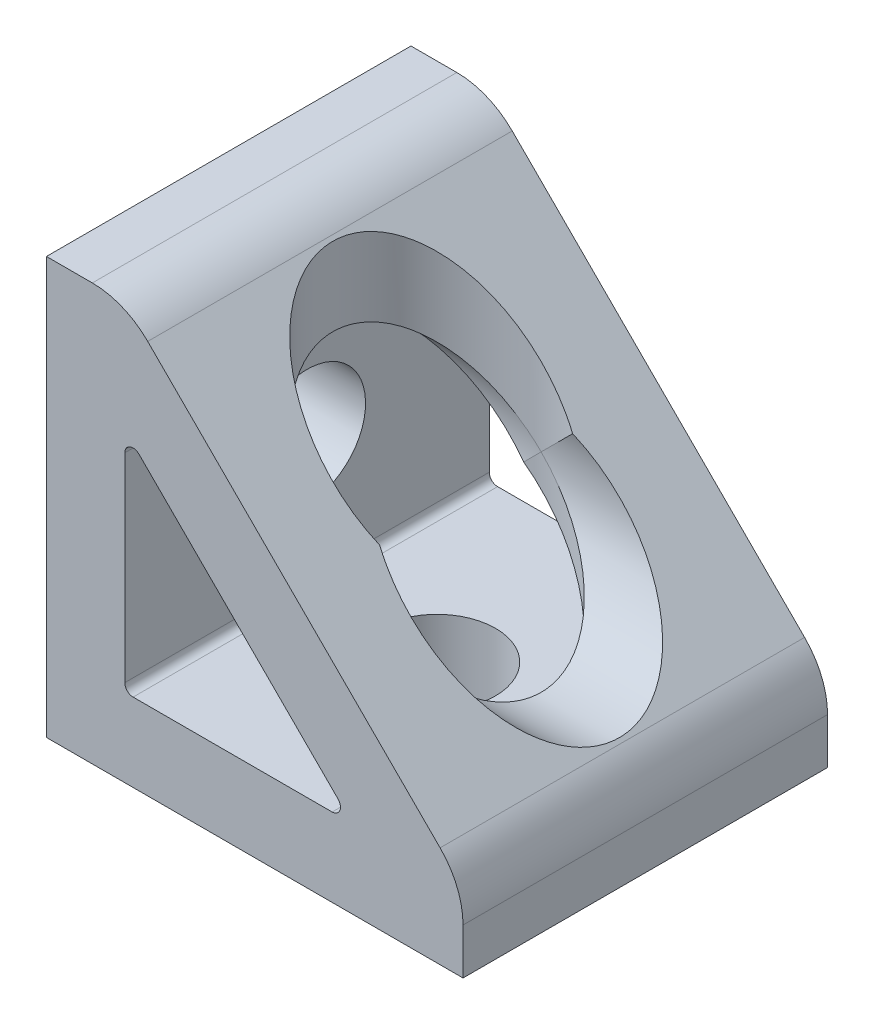
ISO-10303-21;
HEADER;
FILE_DESCRIPTION(('STEP AP214'),'2;1');
FILE_NAME('part.step','',(''),(''),'','','');
FILE_SCHEMA(('AUTOMOTIVE_DESIGN { 1 0 10303 214 1 1 1 1 }'));
ENDSEC;
DATA;
#1=APPLICATION_CONTEXT('core data for automotive mechanical design processes');
#2=APPLICATION_PROTOCOL_DEFINITION('international standard','automotive_design',2000,#1);
#3=PRODUCT_CONTEXT('',#1,'mechanical');
#4=PRODUCT('Part','Part','',(#3));
#5=PRODUCT_RELATED_PRODUCT_CATEGORY('part','',(#4));
#6=PRODUCT_DEFINITION_FORMATION('','',#4);
#7=PRODUCT_DEFINITION_CONTEXT('part definition',#1,'design');
#8=PRODUCT_DEFINITION('design','',#6,#7);
#9=PRODUCT_DEFINITION_SHAPE('','',#8);
#10=(LENGTH_UNIT() NAMED_UNIT(*) SI_UNIT(.MILLI.,.METRE.));
#11=(NAMED_UNIT(*) PLANE_ANGLE_UNIT() SI_UNIT($,.RADIAN.));
#12=(NAMED_UNIT(*) SI_UNIT($,.STERADIAN.) SOLID_ANGLE_UNIT());
#13=UNCERTAINTY_MEASURE_WITH_UNIT(LENGTH_MEASURE(1.E-05),#10,'distance_accuracy_value','');
#14=(GEOMETRIC_REPRESENTATION_CONTEXT(3) GLOBAL_UNCERTAINTY_ASSIGNED_CONTEXT((#13)) GLOBAL_UNIT_ASSIGNED_CONTEXT((#10,
#11,#12)) REPRESENTATION_CONTEXT('',''));
#15=CARTESIAN_POINT('',(0.,0.,0.));
#16=DIRECTION('',(0.,0.,1.));
#17=DIRECTION('',(1.,0.,0.));
#18=AXIS2_PLACEMENT_3D('',#15,#16,#17);
#19=CARTESIAN_POINT('',(12.7,25.4,0.));
#20=DIRECTION('',(0.,-1.,0.));
#21=DIRECTION('',(0.,0.,-1.));
#22=AXIS2_PLACEMENT_3D('',#19,#20,#21);
#23=CYLINDRICAL_SURFACE('',#22,6.35);
#24=CARTESIAN_POINT('',(12.7,17.4752,0.));
#25=DIRECTION('',(-0.707106781186548,-0.707106781186548,0.));
#26=DIRECTION('',(0.707106781186548,-0.707106781186548,0.));
#27=AXIS2_PLACEMENT_3D('',#24,#25,#26);
#28=ELLIPSE('',#27,8.98025612106915,6.35);
#29=CARTESIAN_POINT('',(15.0876,15.0876,-5.88403486053576));
#30=VERTEX_POINT('',#29);
#31=CARTESIAN_POINT('',(15.0876,15.0876,5.88403486053576));
#32=VERTEX_POINT('',#31);
#33=EDGE_CURVE('E354',#30,#32,#28,.F.);
#34=ORIENTED_EDGE('',*,*,#33,.T.);
#35=CARTESIAN_POINT('',(12.7,12.7,0.));
#36=DIRECTION('',(0.707106781186548,-0.707106781186547,0.));
#37=DIRECTION('',(-0.707106781186547,-0.707106781186548,0.));
#38=AXIS2_PLACEMENT_3D('',#35,#36,#37);
#39=ELLIPSE('',#38,8.98025612106915,6.35);
#40=CARTESIAN_POINT('',(12.7,12.7,6.35));
#41=VERTEX_POINT('',#40);
#42=EDGE_CURVE('E176',#32,#41,#39,.T.);
#43=ORIENTED_EDGE('',*,*,#42,.T.);
#44=CARTESIAN_POINT('',(12.7,12.7,0.));
#45=DIRECTION('',(-0.707106781186547,-0.707106781186548,0.));
#46=DIRECTION('',(0.707106781186548,-0.707106781186547,0.));
#47=AXIS2_PLACEMENT_3D('',#44,#45,#46);
#48=ELLIPSE('',#47,8.98025612106915,6.35);
#49=CARTESIAN_POINT('',(12.7,12.7,-6.35));
#50=VERTEX_POINT('',#49);
#51=EDGE_CURVE('E164',#41,#50,#48,.T.);
#52=ORIENTED_EDGE('',*,*,#51,.T.);
#53=CARTESIAN_POINT('',(12.7,12.7,0.));
#54=DIRECTION('',(-0.707106781186548,0.707106781186547,0.));
#55=DIRECTION('',(-0.707106781186547,-0.707106781186548,0.));
#56=AXIS2_PLACEMENT_3D('',#53,#54,#55);
#57=ELLIPSE('',#56,8.98025612106915,6.35);
#58=EDGE_CURVE('E169',#30,#50,#57,.T.);
#59=ORIENTED_EDGE('',*,*,#58,.F.);
#60=EDGE_LOOP('',(#34,#43,#52,#59));
#61=FACE_BOUND('',#60,.T.);
#62=ADVANCED_FACE('F15',(#61),#23,.F.);
#63=CARTESIAN_POINT('',(25.4,12.7,0.));
#64=DIRECTION('',(-1.,0.,0.));
#65=DIRECTION('',(0.,-1.,0.));
#66=AXIS2_PLACEMENT_3D('',#63,#64,#65);
#67=CYLINDRICAL_SURFACE('',#66,6.35);
#68=CARTESIAN_POINT('',(17.4752,12.7,0.));
#69=DIRECTION('',(-0.707106781186548,-0.707106781186548,0.));
#70=DIRECTION('',(-0.707106781186548,0.707106781186548,0.));
#71=AXIS2_PLACEMENT_3D('',#68,#69,#70);
#72=ELLIPSE('',#71,8.98025612106915,6.35);
#73=EDGE_CURVE('E172',#32,#30,#72,.F.);
#74=ORIENTED_EDGE('',*,*,#73,.T.);
#75=ORIENTED_EDGE('',*,*,#58,.T.);
#76=CARTESIAN_POINT('',(12.7,12.7,0.));
#77=DIRECTION('',(-0.707106781186547,-0.707106781186548,0.));
#78=DIRECTION('',(-0.707106781186548,0.707106781186547,0.));
#79=AXIS2_PLACEMENT_3D('',#76,#77,#78);
#80=ELLIPSE('',#79,8.98025612106915,6.35);
#81=EDGE_CURVE('E148',#50,#41,#80,.T.);
#82=ORIENTED_EDGE('',*,*,#81,.T.);
#83=ORIENTED_EDGE('',*,*,#42,.F.);
#84=EDGE_LOOP('',(#74,#75,#82,#83));
#85=FACE_BOUND('',#84,.T.);
#86=ADVANCED_FACE('F170',(#85),#67,.F.);
#87=CARTESIAN_POINT('',(17.4204269072705,5.2832,11.1125));
#88=DIRECTION('',(0.,0.,-1.));
#89=DIRECTION('',(-1.,0.,0.));
#90=AXIS2_PLACEMENT_3D('',#87,#88,#89);
#91=CYLINDRICAL_SURFACE('',#90,0.507999999999998);
#92=CARTESIAN_POINT('',(17.7796371521132,5.64241024484277,3.81048374919394));
#93=CARTESIAN_POINT('',(17.7883333124472,5.63370856311354,3.79889138080289));
#94=CARTESIAN_POINT('',(17.7968318828416,5.62458349521479,3.78747906709042));
#95=CARTESIAN_POINT('',(17.8133986981704,5.60537916131748,3.76508284849013));
#96=CARTESIAN_POINT('',(17.8214656298365,5.59529721644453,3.75410027562521));
#97=CARTESIAN_POINT('',(17.845116428317,5.56322842926829,3.72169206560348));
#98=CARTESIAN_POINT('',(17.8598958230457,5.53966448295931,3.70114636974854));
#99=CARTESIAN_POINT('',(17.8810924886656,5.49805620283357,3.67137249799756));
#100=CARTESIAN_POINT('',(17.8885219657932,5.48144766364685,3.66085708987994));
#101=CARTESIAN_POINT('',(17.9018070766133,5.44654991824729,3.64195486288475));
#102=CARTESIAN_POINT('',(17.9076700681061,5.42826913070793,3.63355810342968));
#103=CARTESIAN_POINT('',(17.9166075365671,5.39336530960493,3.62071223652807));
#104=CARTESIAN_POINT('',(17.9199849010382,5.37697915115832,3.61583705936111));
#105=CARTESIAN_POINT('',(17.9251279628338,5.34343306471349,3.60840111990062));
#106=CARTESIAN_POINT('',(17.9268941679798,5.3262733823132,3.60583962835855));
#107=CARTESIAN_POINT('',(17.9286548266346,5.29160179665178,3.60328620101482));
#108=CARTESIAN_POINT('',(17.9286425196726,5.27408880245012,3.60330406986407));
#109=CARTESIAN_POINT('',(17.9268301762173,5.23935342325999,3.60593241684237));
#110=CARTESIAN_POINT('',(17.9250295700926,5.22213113264778,3.60854372106509));
#111=CARTESIAN_POINT('',(17.9199552088587,5.18942107284772,3.61587965499263));
#112=CARTESIAN_POINT('',(17.9167695871463,5.17389017844441,3.62047776327796));
#113=CARTESIAN_POINT('',(17.9091675862811,5.14377949301812,3.63140709900997));
#114=CARTESIAN_POINT('',(17.9047507311679,5.12920007250359,3.63773899667438));
#115=CARTESIAN_POINT('',(17.8918125900947,5.09229033092581,3.65619671030874));
#116=CARTESIAN_POINT('',(17.8824535417514,5.07082680530542,3.66946707518853));
#117=CARTESIAN_POINT('',(17.8617960798292,5.03067317538378,3.69847020640858));
#118=CARTESIAN_POINT('',(17.8504919154002,5.01199161069783,3.71421026201154));
#119=CARTESIAN_POINT('',(17.8191201500256,4.96654401619267,3.75741714079145));
#120=CARTESIAN_POINT('',(17.7979147534765,4.94180261343145,3.78617800705458));
#121=CARTESIAN_POINT('',(17.753003271266,4.89791670491141,3.84591628870004));
#122=CARTESIAN_POINT('',(17.7292906766661,4.87878727910359,3.87689940277821));
#123=CARTESIAN_POINT('',(17.6686922203378,4.83787692204293,3.95449037561444));
#124=CARTESIAN_POINT('',(17.630748506309,4.81889679757743,4.00175305373392));
#125=CARTESIAN_POINT('',(17.5521217993657,4.79080014757748,4.09673128578227));
#126=CARTESIAN_POINT('',(17.5114440480836,4.78166528938716,4.14444583051086));
#127=CARTESIAN_POINT('',(17.4535207465419,4.77601780812482,4.210364646228));
#128=CARTESIAN_POINT('',(17.4370271200594,4.77520995303944,4.22891486166735));
#129=CARTESIAN_POINT('',(17.4204269072705,4.7752,4.24736033473935));
#130=B_SPLINE_CURVE_WITH_KNOTS('',3,(#92,#93,#94,#95,#96,#97,#98,#99,#100,#101,#102,#103,#104,
#105,#106,#107,#108,#109,#110,#111,#112,#113,#114,#115,#116,#117,#118,#119,#120,#121,#122,#123,
#124,#125,#126,#127,#128,#129),.UNSPECIFIED.,.F.,.F.,(4,2,2,2,2,2,2,2,2,2,2,2,2,2,2,2,2,2,4),
(0.,0.0506837306520263,0.101513794219076,0.204635683435221,0.267505038050829,0.330073685533628,
0.382138884926963,0.434187668203855,0.486434304227522,0.538697587846183,0.588034428624639,
0.637390368159527,0.717669114407369,0.798189421008752,0.927853058393364,1.05786198911492,
1.24743713587404,1.43665866572774,1.51111326173056),.UNSPECIFIED.);
#131=CARTESIAN_POINT('',(17.7796371521132,5.64241024484277,3.81048374919394));
#132=VERTEX_POINT('',#131);
#133=CARTESIAN_POINT('',(17.4204269072705,4.7752,4.24736033473935));
#134=VERTEX_POINT('',#133);
#135=EDGE_CURVE('E159',#132,#134,#130,.T.);
#136=ORIENTED_EDGE('',*,*,#135,.T.);
#137=DIRECTION('',(0.,0.,1.));
#138=VECTOR('',#137,1.);
#139=CARTESIAN_POINT('',(17.4204269072705,4.7752,11.1125));
#140=LINE('',#139,#138);
#141=CARTESIAN_POINT('',(17.4204269072705,4.7752,11.1125));
#142=VERTEX_POINT('',#141);
#143=EDGE_CURVE('E351',#142,#134,#140,.F.);
#144=ORIENTED_EDGE('',*,*,#143,.F.);
#145=CARTESIAN_POINT('',(17.4204269072705,5.2832,11.1125));
#146=DIRECTION('',(0.,0.,-1.));
#147=DIRECTION('',(-1.,0.,0.));
#148=AXIS2_PLACEMENT_3D('',#145,#146,#147);
#149=CIRCLE('',#148,0.507999999999998);
#150=CARTESIAN_POINT('',(17.7796371521132,5.64241024484277,11.1125));
#151=VERTEX_POINT('',#150);
#152=EDGE_CURVE('E436',#151,#142,#149,.T.);
#153=ORIENTED_EDGE('',*,*,#152,.F.);
#154=DIRECTION('',(0.,0.,1.));
#155=VECTOR('',#154,1.);
#156=CARTESIAN_POINT('',(17.7796371521132,5.64241024484277,11.1125));
#157=LINE('',#156,#155);
#158=EDGE_CURVE('E358',#132,#151,#157,.T.);
#159=ORIENTED_EDGE('',*,*,#158,.F.);
#160=EDGE_LOOP('',(#136,#144,#153,#159));
#161=FACE_BOUND('',#160,.T.);
#162=ADVANCED_FACE('F447',(#161),#91,.F.);
#163=CARTESIAN_POINT('',(5.2832,17.4204269072705,11.1125));
#164=DIRECTION('',(0.,0.,-1.));
#165=DIRECTION('',(-1.,0.,0.));
#166=AXIS2_PLACEMENT_3D('',#163,#164,#165);
#167=CYLINDRICAL_SURFACE('',#166,0.508);
#168=CARTESIAN_POINT('',(4.7752,17.4204269072704,4.24736033473935));
#169=CARTESIAN_POINT('',(4.77521046724601,17.4420924856764,4.22328508045935));
#170=CARTESIAN_POINT('',(4.77658605471394,17.4635662308095,4.19904582709387));
#171=CARTESIAN_POINT('',(4.78200159472634,17.5060131520486,4.15039429932005));
#172=CARTESIAN_POINT('',(4.78604351709437,17.5269859461851,4.12598191020381));
#173=CARTESIAN_POINT('',(4.79678199208576,17.5684994852333,4.07691772352855));
#174=CARTESIAN_POINT('',(4.80350610470041,17.5890333365038,4.05226611774794));
#175=CARTESIAN_POINT('',(4.81961765940842,17.6292935812707,4.00319516862432));
#176=CARTESIAN_POINT('',(4.82900389569489,17.6490203357225,3.97877572528728));
#177=CARTESIAN_POINT('',(4.85455357115968,17.6947394093427,3.92133656460339));
#178=CARTESIAN_POINT('',(4.87193874939082,17.7203148602738,3.88851705199913));
#179=CARTESIAN_POINT('',(4.91237240067932,17.7690703949101,3.82473811417215));
#180=CARTESIAN_POINT('',(4.9354004825951,17.7922586856149,3.79377248031576));
#181=CARTESIAN_POINT('',(4.97791824667546,17.8270004785444,3.74658101072067));
#182=CARTESIAN_POINT('',(4.99535181365528,17.8395940700084,3.72927348245638));
#183=CARTESIAN_POINT('',(5.03302106404657,17.863108232783,3.69664903722876));
#184=CARTESIAN_POINT('',(5.05325324857269,17.8740308578064,3.68132968026151));
#185=CARTESIAN_POINT('',(5.09114655378691,17.8910574220427,3.65726436442134));
#186=CARTESIAN_POINT('',(5.10813847665273,17.8976789749363,3.64783982251966));
#187=CARTESIAN_POINT('',(5.14373439367388,17.9092642191962,3.63127642560542));
#188=CARTESIAN_POINT('',(5.16233579994144,17.9142305118781,3.62413398490661));
#189=CARTESIAN_POINT('',(5.19743703216341,17.9213962914119,3.61380042328051));
#190=CARTESIAN_POINT('',(5.21372677322737,17.9239297564496,3.61013390639403));
#191=CARTESIAN_POINT('',(5.24682501316101,17.9273953129222,3.60511413516427));
#192=CARTESIAN_POINT('',(5.26363309486034,17.9283286596024,3.6037590675622));
#193=CARTESIAN_POINT('',(5.29730447707779,17.9285104709857,3.60349529156194));
#194=CARTESIAN_POINT('',(5.31416782281174,17.927756317429,3.60459038473776));
#195=CARTESIAN_POINT('',(5.3474214082833,17.9246285205018,3.60912233530311));
#196=CARTESIAN_POINT('',(5.36381132370793,17.9222537931886,3.61256076005944));
#197=CARTESIAN_POINT('',(5.39943025782155,17.9153565231575,3.62251299486325));
#198=CARTESIAN_POINT('',(5.41843841204279,17.9104640845815,3.62955440383875));
#199=CARTESIAN_POINT('',(5.4548178207322,17.89894290879,3.64603808381968));
#200=CARTESIAN_POINT('',(5.47218546922247,17.892310462367,3.65548548244433));
#201=CARTESIAN_POINT('',(5.51333857652347,17.8741082748739,3.68123036161128));
#202=CARTESIAN_POINT('',(5.53607437061717,17.8617153299734,3.69861048602099));
#203=CARTESIAN_POINT('',(5.57802257558475,17.834874461339,3.7357851633193));
#204=CARTESIAN_POINT('',(5.59723052062932,17.8204239735057,3.75558272435373));
#205=CARTESIAN_POINT('',(5.62450634899135,17.7969006642059,3.78738763194976));
#206=CARTESIAN_POINT('',(5.63367579047622,17.7883611270019,3.79885605078555));
#207=CARTESIAN_POINT('',(5.64241024484278,17.7796371521132,3.81048374919394));
#208=B_SPLINE_CURVE_WITH_KNOTS('',3,(#168,#169,#170,#171,#172,#173,#174,#175,#176,#177,#178,
#179,#180,#181,#182,#183,#184,#185,#186,#187,#188,#189,#190,#191,#192,#193,#194,#195,#196,#197,
#198,#199,#200,#201,#202,#203,#204,#205,#206,#207),.UNSPECIFIED.,.F.,.F.,(4,2,2,2,2,2,2,2,2,2,2,
2,2,2,2,2,2,2,2,4),(0.,0.0971267833027569,0.194325401998055,0.292549599213744,0.390729376712899,
0.525638679797282,0.66006748478254,0.742693286989565,0.825216707102879,0.886598734818593,
0.947883838018685,0.998331037145106,1.0487386438098,1.09922451518082,1.14974418784643,
1.21195644571509,1.27430241571198,1.36734096694783,1.46049649396306,1.511404348917),.UNSPECIFIED.);
#209=CARTESIAN_POINT('',(4.7752,17.4204269072704,4.24736033473935));
#210=VERTEX_POINT('',#209);
#211=CARTESIAN_POINT('',(5.64241024484278,17.7796371521132,3.81048374919394));
#212=VERTEX_POINT('',#211);
#213=EDGE_CURVE('E158',#210,#212,#208,.T.);
#214=ORIENTED_EDGE('',*,*,#213,.T.);
#215=DIRECTION('',(0.,0.,1.));
#216=VECTOR('',#215,1.);
#217=CARTESIAN_POINT('',(5.64241024484278,17.7796371521132,11.1125));
#218=LINE('',#217,#216);
#219=CARTESIAN_POINT('',(5.64241024484277,17.7796371521132,11.1125));
#220=VERTEX_POINT('',#219);
#221=EDGE_CURVE('E219',#220,#212,#218,.F.);
#222=ORIENTED_EDGE('',*,*,#221,.F.);
#223=CARTESIAN_POINT('',(5.2832,17.4204269072705,11.1125));
#224=DIRECTION('',(0.,0.,-1.));
#225=DIRECTION('',(-1.,0.,0.));
#226=AXIS2_PLACEMENT_3D('',#223,#224,#225);
#227=CIRCLE('',#226,0.508);
#228=CARTESIAN_POINT('',(4.7752,17.4204269072705,11.1125));
#229=VERTEX_POINT('',#228);
#230=EDGE_CURVE('E434',#229,#220,#227,.T.);
#231=ORIENTED_EDGE('',*,*,#230,.F.);
#232=DIRECTION('',(0.,0.,1.));
#233=VECTOR('',#232,1.);
#234=CARTESIAN_POINT('',(4.7752,17.4204269072704,11.1125));
#235=LINE('',#234,#233);
#236=EDGE_CURVE('E346',#210,#229,#235,.T.);
#237=ORIENTED_EDGE('',*,*,#236,.F.);
#238=EDGE_LOOP('',(#214,#222,#231,#237));
#239=FACE_BOUND('',#238,.T.);
#240=ADVANCED_FACE('F192',(#239),#167,.F.);
#241=CARTESIAN_POINT('',(5.2832,5.2832,11.1125));
#242=DIRECTION('',(0.,0.,-1.));
#243=DIRECTION('',(-1.,0.,0.));
#244=AXIS2_PLACEMENT_3D('',#241,#242,#243);
#245=CYLINDRICAL_SURFACE('',#244,0.508);
#246=DIRECTION('',(0.,0.,1.));
#247=VECTOR('',#246,1.);
#248=CARTESIAN_POINT('',(4.7752,5.2832,11.1125));
#249=LINE('',#248,#247);
#250=CARTESIAN_POINT('',(4.7752,5.2832,11.1125));
#251=VERTEX_POINT('',#250);
#252=CARTESIAN_POINT('',(4.7752,5.2832,-11.1125));
#253=VERTEX_POINT('',#252);
#254=EDGE_CURVE('E342',#251,#253,#249,.F.);
#255=ORIENTED_EDGE('',*,*,#254,.F.);
#256=CARTESIAN_POINT('',(5.2832,5.2832,11.1125));
#257=DIRECTION('',(0.,0.,-1.));
#258=DIRECTION('',(-1.,0.,0.));
#259=AXIS2_PLACEMENT_3D('',#256,#257,#258);
#260=CIRCLE('',#259,0.508);
#261=CARTESIAN_POINT('',(5.2832,4.7752,11.1125));
#262=VERTEX_POINT('',#261);
#263=EDGE_CURVE('E435',#262,#251,#260,.T.);
#264=ORIENTED_EDGE('',*,*,#263,.F.);
#265=DIRECTION('',(0.,0.,1.));
#266=VECTOR('',#265,1.);
#267=CARTESIAN_POINT('',(5.28320000000001,4.7752,11.1125));
#268=LINE('',#267,#266);
#269=CARTESIAN_POINT('',(5.2832,4.7752,-11.1125));
#270=VERTEX_POINT('',#269);
#271=EDGE_CURVE('E386',#270,#262,#268,.T.);
#272=ORIENTED_EDGE('',*,*,#271,.F.);
#273=CARTESIAN_POINT('',(5.2832,5.2832,-11.1125));
#274=DIRECTION('',(0.,0.,-1.));
#275=DIRECTION('',(-1.,0.,0.));
#276=AXIS2_PLACEMENT_3D('',#273,#274,#275);
#277=CIRCLE('',#276,0.508);
#278=EDGE_CURVE('E428',#253,#270,#277,.F.);
#279=ORIENTED_EDGE('',*,*,#278,.F.);
#280=EDGE_LOOP('',(#255,#264,#272,#279));
#281=FACE_BOUND('',#280,.T.);
#282=ADVANCED_FACE('F520',(#281),#245,.F.);
#283=CARTESIAN_POINT('',(12.7,25.4,0.));
#284=DIRECTION('',(0.,-1.,0.));
#285=DIRECTION('',(0.,0.,-1.));
#286=AXIS2_PLACEMENT_3D('',#283,#284,#285);
#287=CYLINDRICAL_SURFACE('',#286,6.35);
#288=ORIENTED_EDGE('',*,*,#81,.F.);
#289=CARTESIAN_POINT('',(12.7,12.7,0.));
#290=DIRECTION('',(-0.707106781186548,0.707106781186547,0.));
#291=DIRECTION('',(-0.707106781186547,-0.707106781186548,0.));
#292=AXIS2_PLACEMENT_3D('',#289,#290,#291);
#293=ELLIPSE('',#292,8.98025612106915,6.35);
#294=CARTESIAN_POINT('',(11.711023698478,11.711023698478,-6.27251352131088));
#295=VERTEX_POINT('',#294);
#296=EDGE_CURVE('E18',#295,#50,#293,.F.);
#297=ORIENTED_EDGE('',*,*,#296,.F.);
#298=CARTESIAN_POINT('',(12.7,10.722047396956,0.));
#299=DIRECTION('',(-0.707106781186547,-0.707106781186548,0.));
#300=DIRECTION('',(0.707106781186548,-0.707106781186547,0.));
#301=AXIS2_PLACEMENT_3D('',#298,#299,#300);
#302=ELLIPSE('',#301,8.98025612106915,6.35);
#303=CARTESIAN_POINT('',(17.7796371521132,5.64241024484277,-3.81048374919394));
#304=VERTEX_POINT('',#303);
#305=EDGE_CURVE('E336',#304,#295,#302,.F.);
#306=ORIENTED_EDGE('',*,*,#305,.F.);
#307=CARTESIAN_POINT('',(17.7796371521132,5.64241024484277,-3.81048374919394));
#308=CARTESIAN_POINT('',(17.7883333124472,5.63370856311354,-3.79889138080289));
#309=CARTESIAN_POINT('',(17.7968318828416,5.62458349521479,-3.78747906709042));
#310=CARTESIAN_POINT('',(17.8133986981704,5.60537916131748,-3.76508284849013));
#311=CARTESIAN_POINT('',(17.8214656298365,5.59529721644453,-3.75410027562521));
#312=CARTESIAN_POINT('',(17.845116428317,5.56322842926829,-3.72169206560348));
#313=CARTESIAN_POINT('',(17.8598958230457,5.53966448295931,-3.70114636974854));
#314=CARTESIAN_POINT('',(17.8810924886656,5.49805620283357,-3.67137249799756));
#315=CARTESIAN_POINT('',(17.8885219657932,5.48144766364685,-3.66085708987994));
#316=CARTESIAN_POINT('',(17.9018070766133,5.44654991824729,-3.64195486288475));
#317=CARTESIAN_POINT('',(17.9076700681061,5.42826913070793,-3.63355810342969));
#318=CARTESIAN_POINT('',(17.9166075365671,5.39336530960493,-3.62071223652807));
#319=CARTESIAN_POINT('',(17.9199849010382,5.37697915115832,-3.61583705936111));
#320=CARTESIAN_POINT('',(17.9251279628338,5.34343306471349,-3.60840111990062));
#321=CARTESIAN_POINT('',(17.9268941679798,5.3262733823132,-3.60583962835855));
#322=CARTESIAN_POINT('',(17.9286548266346,5.29160179665178,-3.60328620101482));
#323=CARTESIAN_POINT('',(17.9286425196726,5.27408880245012,-3.60330406986407));
#324=CARTESIAN_POINT('',(17.9268301762173,5.23935342325998,-3.60593241684237));
#325=CARTESIAN_POINT('',(17.9250295700926,5.22213113264778,-3.60854372106509));
#326=CARTESIAN_POINT('',(17.9199552088587,5.18942107284772,-3.61587965499263));
#327=CARTESIAN_POINT('',(17.9167695871463,5.17389017844441,-3.62047776327796));
#328=CARTESIAN_POINT('',(17.9091675862811,5.14377949301812,-3.63140709900997));
#329=CARTESIAN_POINT('',(17.9047507311679,5.12920007250359,-3.63773899667438));
#330=CARTESIAN_POINT('',(17.8918125900947,5.0922903309258,-3.65619671030875));
#331=CARTESIAN_POINT('',(17.8824535417514,5.07082680530542,-3.66946707518853));
#332=CARTESIAN_POINT('',(17.8617960798292,5.03067317538378,-3.69847020640858));
#333=CARTESIAN_POINT('',(17.8504919154002,5.01199161069783,-3.71421026201154));
#334=CARTESIAN_POINT('',(17.8191201500256,4.96654401619267,-3.75741714079145));
#335=CARTESIAN_POINT('',(17.7979147534765,4.94180261343145,-3.78617800705458));
#336=CARTESIAN_POINT('',(17.753003271266,4.89791670491141,-3.84591628870004));
#337=CARTESIAN_POINT('',(17.7292906766661,4.87878727910359,-3.87689940277821));
#338=CARTESIAN_POINT('',(17.6686922203378,4.83787692204293,-3.95449037561444));
#339=CARTESIAN_POINT('',(17.630748506309,4.81889679757743,-4.00175305373391));
#340=CARTESIAN_POINT('',(17.5521217993657,4.79080014757748,-4.09673128578227));
#341=CARTESIAN_POINT('',(17.5114440480836,4.78166528938716,-4.14444583051086));
#342=CARTESIAN_POINT('',(17.4535207465419,4.77601780812482,-4.21036464622799));
#343=CARTESIAN_POINT('',(17.4370271200594,4.77520995303944,-4.22891486166735));
#344=CARTESIAN_POINT('',(17.4204269072705,4.7752,-4.24736033473935));
#345=B_SPLINE_CURVE_WITH_KNOTS('',3,(#307,#308,#309,#310,#311,#312,#313,#314,#315,#316,#317,
#318,#319,#320,#321,#322,#323,#324,#325,#326,#327,#328,#329,#330,#331,#332,#333,#334,#335,#336,
#337,#338,#339,#340,#341,#342,#343,#344),.UNSPECIFIED.,.F.,.F.,(4,2,2,2,2,2,2,2,2,2,2,2,2,2,2,2,
2,2,4),(0.,0.050683730652025,0.101513794219074,0.204635683435221,0.267505038050827,
0.330073685533626,0.382138884926962,0.434187668203854,0.486434304227523,0.538697587846184,
0.58803442862464,0.637390368159529,0.717669114407369,0.798189421008751,0.927853058393362,
1.05786198911491,1.24743713587404,1.43665866572773,1.51111326173056),.UNSPECIFIED.);
#346=CARTESIAN_POINT('',(17.4204269072705,4.7752,-4.24736033473934));
#347=VERTEX_POINT('',#346);
#348=EDGE_CURVE('E212',#304,#347,#345,.T.);
#349=ORIENTED_EDGE('',*,*,#348,.T.);
#350=CARTESIAN_POINT('',(12.7,4.7752,0.));
#351=DIRECTION('',(0.,-1.,0.));
#352=DIRECTION('',(0.,0.,-1.));
#353=AXIS2_PLACEMENT_3D('',#350,#351,#352);
#354=CIRCLE('',#353,6.35);
#355=EDGE_CURVE('E348',#134,#347,#354,.F.);
#356=ORIENTED_EDGE('',*,*,#355,.F.);
#357=ORIENTED_EDGE('',*,*,#135,.F.);
#358=CARTESIAN_POINT('',(12.7,10.722047396956,0.));
#359=DIRECTION('',(-0.707106781186547,-0.707106781186548,0.));
#360=DIRECTION('',(0.707106781186548,-0.707106781186547,0.));
#361=AXIS2_PLACEMENT_3D('',#358,#359,#360);
#362=ELLIPSE('',#361,8.98025612106915,6.35);
#363=CARTESIAN_POINT('',(11.711023698478,11.711023698478,6.27251352131088));
#364=VERTEX_POINT('',#363);
#365=EDGE_CURVE('E356',#364,#132,#362,.F.);
#366=ORIENTED_EDGE('',*,*,#365,.F.);
#367=CARTESIAN_POINT('',(12.7,12.7,0.));
#368=DIRECTION('',(-0.707106781186548,0.707106781186547,0.));
#369=DIRECTION('',(-0.707106781186547,-0.707106781186548,0.));
#370=AXIS2_PLACEMENT_3D('',#367,#368,#369);
#371=ELLIPSE('',#370,8.98025612106915,6.35);
#372=EDGE_CURVE('E154',#41,#364,#371,.F.);
#373=ORIENTED_EDGE('',*,*,#372,.F.);
#374=EDGE_LOOP('',(#288,#297,#306,#349,#356,#357,#366,#373));
#375=FACE_BOUND('',#374,.T.);
#376=ADVANCED_FACE('F150',(#375),#287,.F.);
#377=CARTESIAN_POINT('',(25.4,12.7,0.));
#378=DIRECTION('',(-1.,0.,0.));
#379=DIRECTION('',(0.,-1.,0.));
#380=AXIS2_PLACEMENT_3D('',#377,#378,#379);
#381=CYLINDRICAL_SURFACE('',#380,6.35);
#382=ORIENTED_EDGE('',*,*,#296,.T.);
#383=ORIENTED_EDGE('',*,*,#51,.F.);
#384=ORIENTED_EDGE('',*,*,#372,.T.);
#385=CARTESIAN_POINT('',(10.722047396956,12.7,0.));
#386=DIRECTION('',(-0.707106781186547,-0.707106781186548,0.));
#387=DIRECTION('',(-0.707106781186548,0.707106781186547,0.));
#388=AXIS2_PLACEMENT_3D('',#385,#386,#387);
#389=ELLIPSE('',#388,8.98025612106915,6.35);
#390=EDGE_CURVE('E220',#212,#364,#389,.F.);
#391=ORIENTED_EDGE('',*,*,#390,.F.);
#392=ORIENTED_EDGE('',*,*,#213,.F.);
#393=CARTESIAN_POINT('',(4.7752,12.7,0.));
#394=DIRECTION('',(-1.,0.,0.));
#395=DIRECTION('',(0.,-1.,0.));
#396=AXIS2_PLACEMENT_3D('',#393,#394,#395);
#397=CIRCLE('',#396,6.35);
#398=CARTESIAN_POINT('',(4.7752,17.4204269072704,-4.24736033473935));
#399=VERTEX_POINT('',#398);
#400=EDGE_CURVE('E343',#399,#210,#397,.F.);
#401=ORIENTED_EDGE('',*,*,#400,.F.);
#402=CARTESIAN_POINT('',(4.7752,17.4204269072704,-4.24736033473935));
#403=CARTESIAN_POINT('',(4.77521046724601,17.4420924856764,-4.22328508045935));
#404=CARTESIAN_POINT('',(4.77658605471394,17.4635662308095,-4.19904582709387));
#405=CARTESIAN_POINT('',(4.78200159472634,17.5060131520486,-4.15039429932005));
#406=CARTESIAN_POINT('',(4.78604351709437,17.5269859461851,-4.12598191020381));
#407=CARTESIAN_POINT('',(4.79678199208576,17.5684994852333,-4.07691772352855));
#408=CARTESIAN_POINT('',(4.80350610470041,17.5890333365038,-4.05226611774794));
#409=CARTESIAN_POINT('',(4.81961765940842,17.6292935812707,-4.00319516862432));
#410=CARTESIAN_POINT('',(4.82900389569489,17.6490203357225,-3.97877572528728));
#411=CARTESIAN_POINT('',(4.85455357115968,17.6947394093427,-3.92133656460339));
#412=CARTESIAN_POINT('',(4.87193874939082,17.7203148602738,-3.88851705199913));
#413=CARTESIAN_POINT('',(4.91237240067932,17.7690703949101,-3.82473811417215));
#414=CARTESIAN_POINT('',(4.9354004825951,17.7922586856149,-3.79377248031576));
#415=CARTESIAN_POINT('',(4.97791824667546,17.8270004785444,-3.74658101072067));
#416=CARTESIAN_POINT('',(4.99535181365528,17.8395940700084,-3.72927348245638));
#417=CARTESIAN_POINT('',(5.03302106404657,17.863108232783,-3.69664903722876));
#418=CARTESIAN_POINT('',(5.05325324857269,17.8740308578064,-3.68132968026151));
#419=CARTESIAN_POINT('',(5.09114655378691,17.8910574220427,-3.65726436442134));
#420=CARTESIAN_POINT('',(5.10813847665273,17.8976789749363,-3.64783982251966));
#421=CARTESIAN_POINT('',(5.14373439367388,17.9092642191962,-3.63127642560542));
#422=CARTESIAN_POINT('',(5.16233579994144,17.9142305118781,-3.62413398490661));
#423=CARTESIAN_POINT('',(5.19743703216341,17.9213962914119,-3.61380042328051));
#424=CARTESIAN_POINT('',(5.21372677322737,17.9239297564496,-3.61013390639403));
#425=CARTESIAN_POINT('',(5.24682501316101,17.9273953129222,-3.60511413516427));
#426=CARTESIAN_POINT('',(5.26363309486034,17.9283286596024,-3.6037590675622));
#427=CARTESIAN_POINT('',(5.29730447707779,17.9285104709857,-3.60349529156194));
#428=CARTESIAN_POINT('',(5.31416782281174,17.927756317429,-3.60459038473776));
#429=CARTESIAN_POINT('',(5.3474214082833,17.9246285205018,-3.60912233530311));
#430=CARTESIAN_POINT('',(5.36381132370793,17.9222537931886,-3.61256076005944));
#431=CARTESIAN_POINT('',(5.39943025782155,17.9153565231575,-3.62251299486325));
#432=CARTESIAN_POINT('',(5.41843841204279,17.9104640845815,-3.62955440383875));
#433=CARTESIAN_POINT('',(5.4548178207322,17.89894290879,-3.64603808381968));
#434=CARTESIAN_POINT('',(5.47218546922247,17.892310462367,-3.65548548244433));
#435=CARTESIAN_POINT('',(5.51333857652347,17.8741082748739,-3.68123036161128));
#436=CARTESIAN_POINT('',(5.53607437061717,17.8617153299734,-3.69861048602099));
#437=CARTESIAN_POINT('',(5.57802257558475,17.834874461339,-3.7357851633193));
#438=CARTESIAN_POINT('',(5.59723052062932,17.8204239735057,-3.75558272435373));
#439=CARTESIAN_POINT('',(5.62450634899135,17.7969006642059,-3.78738763194976));
#440=CARTESIAN_POINT('',(5.63367579047622,17.7883611270019,-3.79885605078555));
#441=CARTESIAN_POINT('',(5.64241024484278,17.7796371521132,-3.81048374919394));
#442=B_SPLINE_CURVE_WITH_KNOTS('',3,(#402,#403,#404,#405,#406,#407,#408,#409,#410,#411,#412,
#413,#414,#415,#416,#417,#418,#419,#420,#421,#422,#423,#424,#425,#426,#427,#428,#429,#430,#431,
#432,#433,#434,#435,#436,#437,#438,#439,#440,#441),.UNSPECIFIED.,.F.,.F.,(4,2,2,2,2,2,2,2,2,2,2,
2,2,2,2,2,2,2,2,4),(0.,0.0971267833027569,0.194325401998055,0.292549599213744,0.390729376712899,
0.525638679797282,0.66006748478254,0.742693286989565,0.825216707102879,0.886598734818593,
0.947883838018685,0.998331037145106,1.0487386438098,1.09922451518082,1.14974418784643,
1.21195644571509,1.27430241571198,1.36734096694783,1.46049649396306,1.511404348917),.UNSPECIFIED.);
#443=CARTESIAN_POINT('',(5.64241024484278,17.7796371521132,-3.81048374919394));
#444=VERTEX_POINT('',#443);
#445=EDGE_CURVE('E180',#399,#444,#442,.T.);
#446=ORIENTED_EDGE('',*,*,#445,.T.);
#447=CARTESIAN_POINT('',(10.722047396956,12.7,0.));
#448=DIRECTION('',(-0.707106781186547,-0.707106781186548,0.));
#449=DIRECTION('',(-0.707106781186548,0.707106781186547,0.));
#450=AXIS2_PLACEMENT_3D('',#447,#448,#449);
#451=ELLIPSE('',#450,8.98025612106915,6.35);
#452=EDGE_CURVE('E167',#295,#444,#451,.F.);
#453=ORIENTED_EDGE('',*,*,#452,.F.);
#454=EDGE_LOOP('',(#382,#383,#384,#391,#392,#401,#446,#453));
#455=FACE_BOUND('',#454,.T.);
#456=ADVANCED_FACE('F162',(#455),#381,.F.);
#457=CARTESIAN_POINT('',(5.2832,17.4204269072705,11.1125));
#458=DIRECTION('',(0.,0.,-1.));
#459=DIRECTION('',(-1.,0.,0.));
#460=AXIS2_PLACEMENT_3D('',#457,#458,#459);
#461=CYLINDRICAL_SURFACE('',#460,0.508);
#462=ORIENTED_EDGE('',*,*,#445,.F.);
#463=DIRECTION('',(0.,0.,1.));
#464=VECTOR('',#463,1.);
#465=CARTESIAN_POINT('',(4.7752,17.4204269072704,11.1125));
#466=LINE('',#465,#464);
#467=CARTESIAN_POINT('',(4.7752,17.4204269072705,-11.1125));
#468=VERTEX_POINT('',#467);
#469=EDGE_CURVE('E347',#468,#399,#466,.T.);
#470=ORIENTED_EDGE('',*,*,#469,.F.);
#471=CARTESIAN_POINT('',(5.2832,17.4204269072705,-11.1125));
#472=DIRECTION('',(0.,0.,-1.));
#473=DIRECTION('',(-1.,0.,0.));
#474=AXIS2_PLACEMENT_3D('',#471,#472,#473);
#475=CIRCLE('',#474,0.508);
#476=CARTESIAN_POINT('',(5.64241024484277,17.7796371521132,-11.1125));
#477=VERTEX_POINT('',#476);
#478=EDGE_CURVE('E178',#477,#468,#475,.F.);
#479=ORIENTED_EDGE('',*,*,#478,.F.);
#480=DIRECTION('',(0.,0.,1.));
#481=VECTOR('',#480,1.);
#482=CARTESIAN_POINT('',(5.64241024484278,17.7796371521132,11.1125));
#483=LINE('',#482,#481);
#484=EDGE_CURVE('E335',#444,#477,#483,.F.);
#485=ORIENTED_EDGE('',*,*,#484,.F.);
#486=EDGE_LOOP('',(#462,#470,#479,#485));
#487=FACE_BOUND('',#486,.T.);
#488=ADVANCED_FACE('F200',(#487),#461,.F.);
#489=CARTESIAN_POINT('',(17.4204269072705,5.2832,11.1125));
#490=DIRECTION('',(0.,0.,-1.));
#491=DIRECTION('',(-1.,0.,0.));
#492=AXIS2_PLACEMENT_3D('',#489,#490,#491);
#493=CYLINDRICAL_SURFACE('',#492,0.507999999999998);
#494=ORIENTED_EDGE('',*,*,#348,.F.);
#495=DIRECTION('',(0.,0.,1.));
#496=VECTOR('',#495,1.);
#497=CARTESIAN_POINT('',(17.7796371521132,5.64241024484277,11.1125));
#498=LINE('',#497,#496);
#499=CARTESIAN_POINT('',(17.7796371521132,5.64241024484277,-11.1125));
#500=VERTEX_POINT('',#499);
#501=EDGE_CURVE('E333',#500,#304,#498,.T.);
#502=ORIENTED_EDGE('',*,*,#501,.F.);
#503=CARTESIAN_POINT('',(17.4204269072705,5.2832,-11.1125));
#504=DIRECTION('',(0.,0.,-1.));
#505=DIRECTION('',(-1.,0.,0.));
#506=AXIS2_PLACEMENT_3D('',#503,#504,#505);
#507=CIRCLE('',#506,0.507999999999998);
#508=CARTESIAN_POINT('',(17.4204269072705,4.7752,-11.1125));
#509=VERTEX_POINT('',#508);
#510=EDGE_CURVE('E210',#509,#500,#507,.F.);
#511=ORIENTED_EDGE('',*,*,#510,.F.);
#512=DIRECTION('',(0.,0.,1.));
#513=VECTOR('',#512,1.);
#514=CARTESIAN_POINT('',(17.4204269072705,4.7752,11.1125));
#515=LINE('',#514,#513);
#516=EDGE_CURVE('E350',#347,#509,#515,.F.);
#517=ORIENTED_EDGE('',*,*,#516,.F.);
#518=EDGE_LOOP('',(#494,#502,#511,#517));
#519=FACE_BOUND('',#518,.T.);
#520=ADVANCED_FACE('F222',(#519),#493,.F.);
#521=CARTESIAN_POINT('',(25.401,12.7,0.));
#522=DIRECTION('',(-1.,0.,0.));
#523=DIRECTION('',(0.,-1.,0.));
#524=AXIS2_PLACEMENT_3D('',#521,#522,#523);
#525=CYLINDRICAL_SURFACE('',#524,3.5687);
#526=CARTESIAN_POINT('',(4.7752,12.7,0.));
#527=DIRECTION('',(-1.,0.,0.));
#528=DIRECTION('',(0.,-1.,0.));
#529=AXIS2_PLACEMENT_3D('',#526,#527,#528);
#530=CIRCLE('',#529,3.5687);
#531=CARTESIAN_POINT('',(4.7752,9.1313,0.));
#532=VERTEX_POINT('',#531);
#533=EDGE_CURVE('E339',#532,#532,#530,.T.);
#534=ORIENTED_EDGE('',*,*,#533,.F.);
#535=EDGE_LOOP('',(#534));
#536=FACE_BOUND('',#535,.T.);
#537=CARTESIAN_POINT('',(0.,12.7,0.));
#538=DIRECTION('',(-1.,0.,0.));
#539=DIRECTION('',(0.,-1.,0.));
#540=AXIS2_PLACEMENT_3D('',#537,#538,#539);
#541=CIRCLE('',#540,3.5687);
#542=CARTESIAN_POINT('',(0.,9.1313,0.));
#543=VERTEX_POINT('',#542);
#544=EDGE_CURVE('E326',#543,#543,#541,.T.);
#545=ORIENTED_EDGE('',*,*,#544,.T.);
#546=EDGE_LOOP('',(#545));
#547=FACE_BOUND('',#546,.T.);
#548=ADVANCED_FACE('F226',(#536,#547),#525,.F.);
#549=CARTESIAN_POINT('',(5.64241024484278,17.7796371521132,11.1125));
#550=DIRECTION('',(-0.707106781186547,-0.707106781186548,0.));
#551=DIRECTION('',(0.707106781186548,-0.707106781186547,0.));
#552=AXIS2_PLACEMENT_3D('',#549,#550,#551);
#553=PLANE('',#552);
#554=ORIENTED_EDGE('',*,*,#158,.T.);
#555=DIRECTION('',(0.707106781186548,-0.707106781186548,0.));
#556=VECTOR('',#555,1.);
#557=CARTESIAN_POINT('',(5.64241024484278,17.7796371521132,11.1125));
#558=LINE('',#557,#556);
#559=EDGE_CURVE('E322',#220,#151,#558,.T.);
#560=ORIENTED_EDGE('',*,*,#559,.F.);
#561=ORIENTED_EDGE('',*,*,#221,.T.);
#562=ORIENTED_EDGE('',*,*,#390,.T.);
#563=ORIENTED_EDGE('',*,*,#365,.T.);
#564=EDGE_LOOP('',(#554,#560,#561,#562,#563));
#565=FACE_BOUND('',#564,.T.);
#566=ADVANCED_FACE('F230',(#565),#553,.T.);
#567=CARTESIAN_POINT('',(20.6248,2.79724739695599,11.1125));
#568=DIRECTION('',(0.,0.,-1.));
#569=DIRECTION('',(-1.,0.,0.));
#570=AXIS2_PLACEMENT_3D('',#567,#568,#569);
#571=CYLINDRICAL_SURFACE('',#570,4.7752);
#572=CARTESIAN_POINT('',(20.6248,2.79724739695599,11.1125));
#573=DIRECTION('',(0.,0.,-1.));
#574=DIRECTION('',(-1.,0.,0.));
#575=AXIS2_PLACEMENT_3D('',#572,#573,#574);
#576=CIRCLE('',#575,4.7752);
#577=CARTESIAN_POINT('',(25.4,2.79724739695599,11.1125));
#578=VERTEX_POINT('',#577);
#579=CARTESIAN_POINT('',(24.001376301522,6.173823698478,11.1125));
#580=VERTEX_POINT('',#579);
#581=EDGE_CURVE('E324',#578,#580,#576,.F.);
#582=ORIENTED_EDGE('',*,*,#581,.F.);
#583=DIRECTION('',(0.,0.,1.));
#584=VECTOR('',#583,1.);
#585=CARTESIAN_POINT('',(25.4,2.79724739695598,11.1125));
#586=LINE('',#585,#584);
#587=CARTESIAN_POINT('',(25.4,2.79724739695599,-11.1125));
#588=VERTEX_POINT('',#587);
#589=EDGE_CURVE('E370',#578,#588,#586,.F.);
#590=ORIENTED_EDGE('',*,*,#589,.T.);
#591=CARTESIAN_POINT('',(20.6248,2.79724739695599,-11.1125));
#592=DIRECTION('',(0.,0.,-1.));
#593=DIRECTION('',(-1.,0.,0.));
#594=AXIS2_PLACEMENT_3D('',#591,#592,#593);
#595=CIRCLE('',#594,4.7752);
#596=CARTESIAN_POINT('',(24.001376301522,6.173823698478,-11.1125));
#597=VERTEX_POINT('',#596);
#598=EDGE_CURVE('E316',#588,#597,#595,.F.);
#599=ORIENTED_EDGE('',*,*,#598,.T.);
#600=DIRECTION('',(0.,0.,1.));
#601=VECTOR('',#600,1.);
#602=CARTESIAN_POINT('',(24.001376301522,6.17382369847801,11.1125));
#603=LINE('',#602,#601);
#604=EDGE_CURVE('E355',#597,#580,#603,.T.);
#605=ORIENTED_EDGE('',*,*,#604,.T.);
#606=EDGE_LOOP('',(#582,#590,#599,#605));
#607=FACE_BOUND('',#606,.T.);
#608=ADVANCED_FACE('F234',(#607),#571,.T.);
#609=CARTESIAN_POINT('',(6.17382369847801,24.001376301522,11.1125));
#610=DIRECTION('',(-0.707106781186548,-0.707106781186548,0.));
#611=DIRECTION('',(0.707106781186548,-0.707106781186548,0.));
#612=AXIS2_PLACEMENT_3D('',#609,#610,#611);
#613=PLANE('',#612);
#614=ORIENTED_EDGE('',*,*,#33,.F.);
#615=ORIENTED_EDGE('',*,*,#73,.F.);
#616=EDGE_LOOP('',(#614,#615));
#617=FACE_BOUND('',#616,.T.);
#618=DIRECTION('',(0.,0.,-1.));
#619=VECTOR('',#618,1.);
#620=CARTESIAN_POINT('',(6.17382369847801,24.001376301522,11.1125));
#621=LINE('',#620,#619);
#622=CARTESIAN_POINT('',(6.173823698478,24.001376301522,11.1125));
#623=VERTEX_POINT('',#622);
#624=CARTESIAN_POINT('',(6.173823698478,24.001376301522,-11.1125));
#625=VERTEX_POINT('',#624);
#626=EDGE_CURVE('E353',#623,#625,#621,.T.);
#627=ORIENTED_EDGE('',*,*,#626,.F.);
#628=DIRECTION('',(-0.707106781186548,0.707106781186547,0.));
#629=VECTOR('',#628,1.);
#630=CARTESIAN_POINT('',(24.001376301522,6.17382369847801,11.1125));
#631=LINE('',#630,#629);
#632=EDGE_CURVE('E323',#580,#623,#631,.T.);
#633=ORIENTED_EDGE('',*,*,#632,.F.);
#634=ORIENTED_EDGE('',*,*,#604,.F.);
#635=DIRECTION('',(-0.707106781186548,0.707106781186547,0.));
#636=VECTOR('',#635,1.);
#637=CARTESIAN_POINT('',(24.001376301522,6.17382369847801,-11.1125));
#638=LINE('',#637,#636);
#639=EDGE_CURVE('E315',#597,#625,#638,.T.);
#640=ORIENTED_EDGE('',*,*,#639,.T.);
#641=EDGE_LOOP('',(#627,#633,#634,#640));
#642=FACE_BOUND('',#641,.T.);
#643=ADVANCED_FACE('F238',(#617,#642),#613,.F.);
#644=CARTESIAN_POINT('',(2.79724739695599,20.6248,11.1125));
#645=DIRECTION('',(0.,0.,-1.));
#646=DIRECTION('',(-1.,0.,0.));
#647=AXIS2_PLACEMENT_3D('',#644,#645,#646);
#648=CYLINDRICAL_SURFACE('',#647,4.7752);
#649=CARTESIAN_POINT('',(2.79724739695599,20.6248,11.1125));
#650=DIRECTION('',(0.,0.,-1.));
#651=DIRECTION('',(-1.,0.,0.));
#652=AXIS2_PLACEMENT_3D('',#649,#650,#651);
#653=CIRCLE('',#652,4.7752);
#654=CARTESIAN_POINT('',(2.79724739695599,25.4,11.1125));
#655=VERTEX_POINT('',#654);
#656=EDGE_CURVE('E319',#623,#655,#653,.F.);
#657=ORIENTED_EDGE('',*,*,#656,.F.);
#658=ORIENTED_EDGE('',*,*,#626,.T.);
#659=CARTESIAN_POINT('',(2.79724739695599,20.6248,-11.1125));
#660=DIRECTION('',(0.,0.,-1.));
#661=DIRECTION('',(-1.,0.,0.));
#662=AXIS2_PLACEMENT_3D('',#659,#660,#661);
#663=CIRCLE('',#662,4.7752);
#664=CARTESIAN_POINT('',(2.79724739695599,25.4,-11.1125));
#665=VERTEX_POINT('',#664);
#666=EDGE_CURVE('E311',#625,#665,#663,.F.);
#667=ORIENTED_EDGE('',*,*,#666,.T.);
#668=DIRECTION('',(0.,0.,1.));
#669=VECTOR('',#668,1.);
#670=CARTESIAN_POINT('',(2.79724739695598,25.4,11.1125));
#671=LINE('',#670,#669);
#672=EDGE_CURVE('E382',#665,#655,#671,.T.);
#673=ORIENTED_EDGE('',*,*,#672,.T.);
#674=EDGE_LOOP('',(#657,#658,#667,#673));
#675=FACE_BOUND('',#674,.T.);
#676=ADVANCED_FACE('F242',(#675),#648,.T.);
#677=CARTESIAN_POINT('',(2.79724739695598,25.4,11.1125));
#678=DIRECTION('',(0.,-1.,0.));
#679=DIRECTION('',(1.,0.,0.));
#680=AXIS2_PLACEMENT_3D('',#677,#678,#679);
#681=PLANE('',#680);
#682=DIRECTION('',(0.,0.,1.));
#683=VECTOR('',#682,1.);
#684=CARTESIAN_POINT('',(0.,25.4,11.1125));
#685=LINE('',#684,#683);
#686=CARTESIAN_POINT('',(0.,25.4,-11.1125));
#687=VERTEX_POINT('',#686);
#688=CARTESIAN_POINT('',(0.,25.4,11.1125));
#689=VERTEX_POINT('',#688);
#690=EDGE_CURVE('E329',#687,#689,#685,.T.);
#691=ORIENTED_EDGE('',*,*,#690,.T.);
#692=DIRECTION('',(1.,0.,0.));
#693=VECTOR('',#692,1.);
#694=CARTESIAN_POINT('',(20.6248,25.4,11.1125));
#695=LINE('',#694,#693);
#696=EDGE_CURVE('E375',#655,#689,#695,.F.);
#697=ORIENTED_EDGE('',*,*,#696,.F.);
#698=ORIENTED_EDGE('',*,*,#672,.F.);
#699=DIRECTION('',(1.,0.,0.));
#700=VECTOR('',#699,1.);
#701=CARTESIAN_POINT('',(20.6248,25.4,-11.1125));
#702=LINE('',#701,#700);
#703=EDGE_CURVE('E314',#665,#687,#702,.F.);
#704=ORIENTED_EDGE('',*,*,#703,.T.);
#705=EDGE_LOOP('',(#691,#697,#698,#704));
#706=FACE_BOUND('',#705,.T.);
#707=ADVANCED_FACE('F246',(#706),#681,.F.);
#708=CARTESIAN_POINT('',(5.28320000000001,4.7752,11.1125));
#709=DIRECTION('',(0.,1.,0.));
#710=DIRECTION('',(-1.,0.,0.));
#711=AXIS2_PLACEMENT_3D('',#708,#709,#710);
#712=PLANE('',#711);
#713=CARTESIAN_POINT('',(12.7,4.7752,0.));
#714=DIRECTION('',(0.,-1.,0.));
#715=DIRECTION('',(0.,0.,-1.));
#716=AXIS2_PLACEMENT_3D('',#713,#714,#715);
#717=CIRCLE('',#716,3.5687);
#718=CARTESIAN_POINT('',(12.7,4.7752,-3.5687));
#719=VERTEX_POINT('',#718);
#720=EDGE_CURVE('E330',#719,#719,#717,.T.);
#721=ORIENTED_EDGE('',*,*,#720,.T.);
#722=EDGE_LOOP('',(#721));
#723=FACE_BOUND('',#722,.T.);
#724=ORIENTED_EDGE('',*,*,#271,.T.);
#725=DIRECTION('',(1.,0.,0.));
#726=VECTOR('',#725,1.);
#727=CARTESIAN_POINT('',(20.6248,4.7752,11.1125));
#728=LINE('',#727,#726);
#729=EDGE_CURVE('E406',#142,#262,#728,.F.);
#730=ORIENTED_EDGE('',*,*,#729,.F.);
#731=ORIENTED_EDGE('',*,*,#143,.T.);
#732=ORIENTED_EDGE('',*,*,#355,.T.);
#733=ORIENTED_EDGE('',*,*,#516,.T.);
#734=DIRECTION('',(1.,0.,0.));
#735=VECTOR('',#734,1.);
#736=CARTESIAN_POINT('',(20.6248,4.7752,-11.1125));
#737=LINE('',#736,#735);
#738=EDGE_CURVE('E416',#509,#270,#737,.F.);
#739=ORIENTED_EDGE('',*,*,#738,.T.);
#740=EDGE_LOOP('',(#724,#730,#731,#732,#733,#739));
#741=FACE_BOUND('',#740,.T.);
#742=ADVANCED_FACE('F250',(#723,#741),#712,.T.);
#743=CARTESIAN_POINT('',(4.7752,17.4204269072704,11.1125));
#744=DIRECTION('',(1.,0.,0.));
#745=DIRECTION('',(0.,1.,0.));
#746=AXIS2_PLACEMENT_3D('',#743,#744,#745);
#747=PLANE('',#746);
#748=ORIENTED_EDGE('',*,*,#533,.T.);
#749=EDGE_LOOP('',(#748));
#750=FACE_BOUND('',#749,.T.);
#751=ORIENTED_EDGE('',*,*,#254,.T.);
#752=DIRECTION('',(0.,1.,0.));
#753=VECTOR('',#752,1.);
#754=CARTESIAN_POINT('',(4.7752,2.79724739695599,-11.1125));
#755=LINE('',#754,#753);
#756=EDGE_CURVE('E305',#253,#468,#755,.T.);
#757=ORIENTED_EDGE('',*,*,#756,.T.);
#758=ORIENTED_EDGE('',*,*,#469,.T.);
#759=ORIENTED_EDGE('',*,*,#400,.T.);
#760=ORIENTED_EDGE('',*,*,#236,.T.);
#761=DIRECTION('',(0.,1.,0.));
#762=VECTOR('',#761,1.);
#763=CARTESIAN_POINT('',(4.7752,2.79724739695599,11.1125));
#764=LINE('',#763,#762);
#765=EDGE_CURVE('E371',#251,#229,#764,.T.);
#766=ORIENTED_EDGE('',*,*,#765,.F.);
#767=EDGE_LOOP('',(#751,#757,#758,#759,#760,#766));
#768=FACE_BOUND('',#767,.T.);
#769=ADVANCED_FACE('F254',(#750,#768),#747,.T.);
#770=CARTESIAN_POINT('',(5.64241024484278,17.7796371521132,11.1125));
#771=DIRECTION('',(-0.707106781186547,-0.707106781186548,0.));
#772=DIRECTION('',(0.707106781186548,-0.707106781186547,0.));
#773=AXIS2_PLACEMENT_3D('',#770,#771,#772);
#774=PLANE('',#773);
#775=DIRECTION('',(0.707106781186548,-0.707106781186548,0.));
#776=VECTOR('',#775,1.);
#777=CARTESIAN_POINT('',(5.64241024484278,17.7796371521132,-11.1125));
#778=LINE('',#777,#776);
#779=EDGE_CURVE('E299',#477,#500,#778,.T.);
#780=ORIENTED_EDGE('',*,*,#779,.T.);
#781=ORIENTED_EDGE('',*,*,#501,.T.);
#782=ORIENTED_EDGE('',*,*,#305,.T.);
#783=ORIENTED_EDGE('',*,*,#452,.T.);
#784=ORIENTED_EDGE('',*,*,#484,.T.);
#785=EDGE_LOOP('',(#780,#781,#782,#783,#784));
#786=FACE_BOUND('',#785,.T.);
#787=ADVANCED_FACE('F258',(#786),#774,.T.);
#788=CARTESIAN_POINT('',(12.7,25.401,0.));
#789=DIRECTION('',(0.,-1.,0.));
#790=DIRECTION('',(0.,0.,-1.));
#791=AXIS2_PLACEMENT_3D('',#788,#789,#790);
#792=CYLINDRICAL_SURFACE('',#791,3.5687);
#793=ORIENTED_EDGE('',*,*,#720,.F.);
#794=EDGE_LOOP('',(#793));
#795=FACE_BOUND('',#794,.T.);
#796=CARTESIAN_POINT('',(12.7,0.,0.));
#797=DIRECTION('',(0.,-1.,0.));
#798=DIRECTION('',(0.,0.,-1.));
#799=AXIS2_PLACEMENT_3D('',#796,#797,#798);
#800=CIRCLE('',#799,3.5687);
#801=CARTESIAN_POINT('',(12.7,0.,-3.5687));
#802=VERTEX_POINT('',#801);
#803=EDGE_CURVE('E296',#802,#802,#800,.T.);
#804=ORIENTED_EDGE('',*,*,#803,.T.);
#805=EDGE_LOOP('',(#804));
#806=FACE_BOUND('',#805,.T.);
#807=ADVANCED_FACE('F262',(#795,#806),#792,.F.);
#808=CARTESIAN_POINT('',(0.,25.4,11.1125));
#809=DIRECTION('',(1.,0.,0.));
#810=DIRECTION('',(0.,1.,0.));
#811=AXIS2_PLACEMENT_3D('',#808,#809,#810);
#812=PLANE('',#811);
#813=DIRECTION('',(0.,0.,1.));
#814=VECTOR('',#813,1.);
#815=CARTESIAN_POINT('',(0.,0.,11.1125));
#816=LINE('',#815,#814);
#817=CARTESIAN_POINT('',(0.,0.,-11.1125));
#818=VERTEX_POINT('',#817);
#819=CARTESIAN_POINT('',(0.,0.,11.1125));
#820=VERTEX_POINT('',#819);
#821=EDGE_CURVE('E298',#818,#820,#816,.T.);
#822=ORIENTED_EDGE('',*,*,#821,.T.);
#823=DIRECTION('',(0.,1.,0.));
#824=VECTOR('',#823,1.);
#825=CARTESIAN_POINT('',(0.,2.79724739695599,11.1125));
#826=LINE('',#825,#824);
#827=EDGE_CURVE('E309',#689,#820,#826,.F.);
#828=ORIENTED_EDGE('',*,*,#827,.F.);
#829=ORIENTED_EDGE('',*,*,#690,.F.);
#830=DIRECTION('',(0.,1.,0.));
#831=VECTOR('',#830,1.);
#832=CARTESIAN_POINT('',(0.,2.79724739695599,-11.1125));
#833=LINE('',#832,#831);
#834=EDGE_CURVE('E378',#687,#818,#833,.F.);
#835=ORIENTED_EDGE('',*,*,#834,.T.);
#836=EDGE_LOOP('',(#822,#828,#829,#835));
#837=FACE_BOUND('',#836,.T.);
#838=ORIENTED_EDGE('',*,*,#544,.F.);
#839=EDGE_LOOP('',(#838));
#840=FACE_BOUND('',#839,.T.);
#841=ADVANCED_FACE('F266',(#837,#840),#812,.F.);
#842=CARTESIAN_POINT('',(20.6248,2.79724739695599,11.1125));
#843=DIRECTION('',(0.,0.,1.));
#844=DIRECTION('',(1.,0.,0.));
#845=AXIS2_PLACEMENT_3D('',#842,#843,#844);
#846=PLANE('',#845);
#847=ORIENTED_EDGE('',*,*,#765,.T.);
#848=ORIENTED_EDGE('',*,*,#230,.T.);
#849=ORIENTED_EDGE('',*,*,#559,.T.);
#850=ORIENTED_EDGE('',*,*,#152,.T.);
#851=ORIENTED_EDGE('',*,*,#729,.T.);
#852=ORIENTED_EDGE('',*,*,#263,.T.);
#853=EDGE_LOOP('',(#847,#848,#849,#850,#851,#852));
#854=FACE_BOUND('',#853,.T.);
#855=ORIENTED_EDGE('',*,*,#632,.T.);
#856=ORIENTED_EDGE('',*,*,#656,.T.);
#857=ORIENTED_EDGE('',*,*,#696,.T.);
#858=ORIENTED_EDGE('',*,*,#827,.T.);
#859=DIRECTION('',(1.,0.,0.));
#860=VECTOR('',#859,1.);
#861=CARTESIAN_POINT('',(0.,0.,11.1125));
#862=LINE('',#861,#860);
#863=CARTESIAN_POINT('',(25.4,0.,11.1125));
#864=VERTEX_POINT('',#863);
#865=EDGE_CURVE('E302',#820,#864,#862,.T.);
#866=ORIENTED_EDGE('',*,*,#865,.T.);
#867=DIRECTION('',(0.,-1.,0.));
#868=VECTOR('',#867,1.);
#869=CARTESIAN_POINT('',(25.4,0.,11.1125));
#870=LINE('',#869,#868);
#871=EDGE_CURVE('E368',#864,#578,#870,.F.);
#872=ORIENTED_EDGE('',*,*,#871,.T.);
#873=ORIENTED_EDGE('',*,*,#581,.T.);
#874=EDGE_LOOP('',(#855,#856,#857,#858,#866,#872,#873));
#875=FACE_BOUND('',#874,.T.);
#876=ADVANCED_FACE('F270',(#854,#875),#846,.T.);
#877=CARTESIAN_POINT('',(25.4,0.,11.1125));
#878=DIRECTION('',(-1.,0.,0.));
#879=DIRECTION('',(0.,-1.,0.));
#880=AXIS2_PLACEMENT_3D('',#877,#878,#879);
#881=PLANE('',#880);
#882=ORIENTED_EDGE('',*,*,#589,.F.);
#883=ORIENTED_EDGE('',*,*,#871,.F.);
#884=DIRECTION('',(0.,0.,1.));
#885=VECTOR('',#884,1.);
#886=CARTESIAN_POINT('',(25.4,0.,11.1125));
#887=LINE('',#886,#885);
#888=CARTESIAN_POINT('',(25.4,0.,-11.1125));
#889=VERTEX_POINT('',#888);
#890=EDGE_CURVE('E24',#864,#889,#887,.F.);
#891=ORIENTED_EDGE('',*,*,#890,.T.);
#892=DIRECTION('',(0.,1.,0.));
#893=VECTOR('',#892,1.);
#894=CARTESIAN_POINT('',(25.4,2.79724739695599,-11.1125));
#895=LINE('',#894,#893);
#896=EDGE_CURVE('E32',#889,#588,#895,.T.);
#897=ORIENTED_EDGE('',*,*,#896,.T.);
#898=EDGE_LOOP('',(#882,#883,#891,#897));
#899=FACE_BOUND('',#898,.T.);
#900=ADVANCED_FACE('F274',(#899),#881,.F.);
#901=CARTESIAN_POINT('',(20.6248,2.79724739695599,-11.1125));
#902=DIRECTION('',(0.,0.,1.));
#903=DIRECTION('',(1.,0.,0.));
#904=AXIS2_PLACEMENT_3D('',#901,#902,#903);
#905=PLANE('',#904);
#906=ORIENTED_EDGE('',*,*,#779,.F.);
#907=ORIENTED_EDGE('',*,*,#478,.T.);
#908=ORIENTED_EDGE('',*,*,#756,.F.);
#909=ORIENTED_EDGE('',*,*,#278,.T.);
#910=ORIENTED_EDGE('',*,*,#738,.F.);
#911=ORIENTED_EDGE('',*,*,#510,.T.);
#912=EDGE_LOOP('',(#906,#907,#908,#909,#910,#911));
#913=FACE_BOUND('',#912,.T.);
#914=ORIENTED_EDGE('',*,*,#666,.F.);
#915=ORIENTED_EDGE('',*,*,#639,.F.);
#916=ORIENTED_EDGE('',*,*,#598,.F.);
#917=ORIENTED_EDGE('',*,*,#896,.F.);
#918=DIRECTION('',(1.,0.,0.));
#919=VECTOR('',#918,1.);
#920=CARTESIAN_POINT('',(0.,0.,-11.1125));
#921=LINE('',#920,#919);
#922=EDGE_CURVE('E10',#889,#818,#921,.F.);
#923=ORIENTED_EDGE('',*,*,#922,.T.);
#924=ORIENTED_EDGE('',*,*,#834,.F.);
#925=ORIENTED_EDGE('',*,*,#703,.F.);
#926=EDGE_LOOP('',(#914,#915,#916,#917,#923,#924,#925));
#927=FACE_BOUND('',#926,.T.);
#928=ADVANCED_FACE('F278',(#913,#927),#905,.F.);
#929=CARTESIAN_POINT('',(0.,0.,11.1125));
#930=DIRECTION('',(0.,1.,0.));
#931=DIRECTION('',(0.,0.,1.));
#932=AXIS2_PLACEMENT_3D('',#929,#930,#931);
#933=PLANE('',#932);
#934=ORIENTED_EDGE('',*,*,#890,.F.);
#935=ORIENTED_EDGE('',*,*,#865,.F.);
#936=ORIENTED_EDGE('',*,*,#821,.F.);
#937=ORIENTED_EDGE('',*,*,#922,.F.);
#938=EDGE_LOOP('',(#934,#935,#936,#937));
#939=FACE_BOUND('',#938,.T.);
#940=ORIENTED_EDGE('',*,*,#803,.F.);
#941=EDGE_LOOP('',(#940));
#942=FACE_BOUND('',#941,.T.);
#943=ADVANCED_FACE('F282',(#939,#942),#933,.F.);
#944=CLOSED_SHELL('',(#62,#86,#162,#240,#282,#376,#456,#488,#520,#548,#566,#608,#643,#676,#707,
#742,#769,#787,#807,#841,#876,#900,#928,#943));
#945=MANIFOLD_SOLID_BREP('B1',#944);
#946=ADVANCED_BREP_SHAPE_REPRESENTATION('',(#18,#945),#14);
#947=SHAPE_DEFINITION_REPRESENTATION(#9,#946);
ENDSEC;
END-ISO-10303-21;
